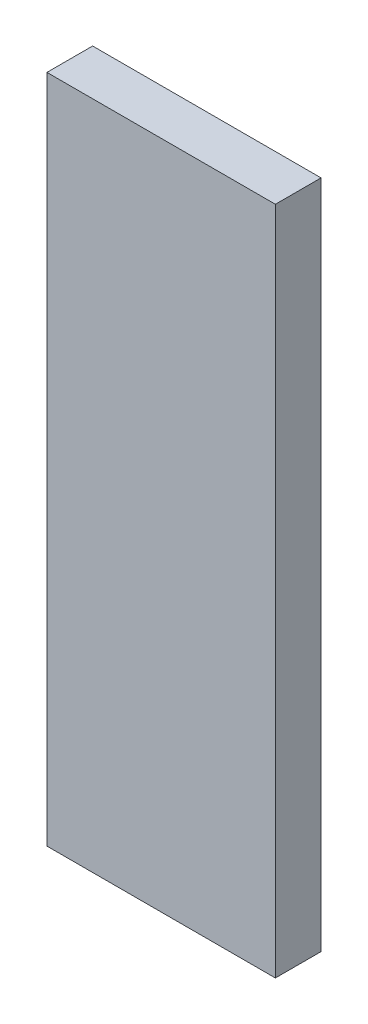
ISO-10303-21;
HEADER;
FILE_DESCRIPTION(('STEP AP214'),'2;1');
FILE_NAME('part.step','',(''),(''),'','','');
FILE_SCHEMA(('AUTOMOTIVE_DESIGN { 1 0 10303 214 1 1 1 1 }'));
ENDSEC;
DATA;
#1=APPLICATION_CONTEXT('core data for automotive mechanical design processes');
#2=APPLICATION_PROTOCOL_DEFINITION('international standard','automotive_design',2000,#1);
#3=PRODUCT_CONTEXT('',#1,'mechanical');
#4=PRODUCT('Part','Part','',(#3));
#5=PRODUCT_RELATED_PRODUCT_CATEGORY('part','',(#4));
#6=PRODUCT_DEFINITION_FORMATION('','',#4);
#7=PRODUCT_DEFINITION_CONTEXT('part definition',#1,'design');
#8=PRODUCT_DEFINITION('design','',#6,#7);
#9=PRODUCT_DEFINITION_SHAPE('','',#8);
#10=(LENGTH_UNIT() NAMED_UNIT(*) SI_UNIT(.MILLI.,.METRE.));
#11=(NAMED_UNIT(*) PLANE_ANGLE_UNIT() SI_UNIT($,.RADIAN.));
#12=(NAMED_UNIT(*) SI_UNIT($,.STERADIAN.) SOLID_ANGLE_UNIT());
#13=UNCERTAINTY_MEASURE_WITH_UNIT(LENGTH_MEASURE(1.E-05),#10,'distance_accuracy_value','');
#14=(GEOMETRIC_REPRESENTATION_CONTEXT(3) GLOBAL_UNCERTAINTY_ASSIGNED_CONTEXT((#13)) GLOBAL_UNIT_ASSIGNED_CONTEXT((#10,
#11,#12)) REPRESENTATION_CONTEXT('',''));
#15=CARTESIAN_POINT('',(0.,0.,0.));
#16=DIRECTION('',(0.,0.,1.));
#17=DIRECTION('',(1.,0.,0.));
#18=AXIS2_PLACEMENT_3D('',#15,#16,#17);
#19=CARTESIAN_POINT('',(7.5,-22.,3.));
#20=DIRECTION('',(-1.,0.,0.));
#21=DIRECTION('',(0.,0.,1.));
#22=AXIS2_PLACEMENT_3D('',#19,#20,#21);
#23=PLANE('',#22);
#24=DIRECTION('',(0.,1.,0.));
#25=VECTOR('',#24,1.);
#26=CARTESIAN_POINT('',(7.5,-22.,0.));
#27=LINE('',#26,#25);
#28=CARTESIAN_POINT('',(7.5,-22.,0.));
#29=VERTEX_POINT('',#28);
#30=CARTESIAN_POINT('',(7.5,22.,0.));
#31=VERTEX_POINT('',#30);
#32=EDGE_CURVE('E103',#29,#31,#27,.T.);
#33=ORIENTED_EDGE('',*,*,#32,.T.);
#34=DIRECTION('',(0.,0.,-1.));
#35=VECTOR('',#34,1.);
#36=CARTESIAN_POINT('',(7.5,22.,3.));
#37=LINE('',#36,#35);
#38=CARTESIAN_POINT('',(7.5,22.,3.));
#39=VERTEX_POINT('',#38);
#40=EDGE_CURVE('E11',#39,#31,#37,.T.);
#41=ORIENTED_EDGE('',*,*,#40,.F.);
#42=DIRECTION('',(0.,1.,0.));
#43=VECTOR('',#42,1.);
#44=CARTESIAN_POINT('',(7.5,-22.,3.));
#45=LINE('',#44,#43);
#46=CARTESIAN_POINT('',(7.5,-22.,3.));
#47=VERTEX_POINT('',#46);
#48=EDGE_CURVE('E91',#47,#39,#45,.T.);
#49=ORIENTED_EDGE('',*,*,#48,.F.);
#50=DIRECTION('',(0.,0.,-1.));
#51=VECTOR('',#50,1.);
#52=CARTESIAN_POINT('',(7.5,-22.,3.));
#53=LINE('',#52,#51);
#54=EDGE_CURVE('E99',#47,#29,#53,.T.);
#55=ORIENTED_EDGE('',*,*,#54,.T.);
#56=EDGE_LOOP('',(#33,#41,#49,#55));
#57=FACE_BOUND('',#56,.T.);
#58=ADVANCED_FACE('F40',(#57),#23,.F.);
#59=CARTESIAN_POINT('',(-7.5,22.,3.));
#60=DIRECTION('',(0.,-1.,0.));
#61=DIRECTION('',(0.,0.,-1.));
#62=AXIS2_PLACEMENT_3D('',#59,#60,#61);
#63=PLANE('',#62);
#64=DIRECTION('',(-1.,0.,0.));
#65=VECTOR('',#64,1.);
#66=CARTESIAN_POINT('',(-7.5,22.,0.));
#67=LINE('',#66,#65);
#68=CARTESIAN_POINT('',(-7.5,22.,0.));
#69=VERTEX_POINT('',#68);
#70=EDGE_CURVE('E95',#31,#69,#67,.T.);
#71=ORIENTED_EDGE('',*,*,#70,.T.);
#72=DIRECTION('',(0.,0.,-1.));
#73=VECTOR('',#72,1.);
#74=CARTESIAN_POINT('',(-7.5,22.,3.));
#75=LINE('',#74,#73);
#76=CARTESIAN_POINT('',(-7.5,22.,3.));
#77=VERTEX_POINT('',#76);
#78=EDGE_CURVE('E48',#77,#69,#75,.T.);
#79=ORIENTED_EDGE('',*,*,#78,.F.);
#80=DIRECTION('',(-1.,0.,0.));
#81=VECTOR('',#80,1.);
#82=CARTESIAN_POINT('',(-7.5,22.,3.));
#83=LINE('',#82,#81);
#84=EDGE_CURVE('E86',#39,#77,#83,.T.);
#85=ORIENTED_EDGE('',*,*,#84,.F.);
#86=ORIENTED_EDGE('',*,*,#40,.T.);
#87=EDGE_LOOP('',(#71,#79,#85,#86));
#88=FACE_BOUND('',#87,.T.);
#89=ADVANCED_FACE('F94',(#88),#63,.F.);
#90=CARTESIAN_POINT('',(-7.5,-22.,3.));
#91=DIRECTION('',(1.,0.,0.));
#92=DIRECTION('',(0.,0.,-1.));
#93=AXIS2_PLACEMENT_3D('',#90,#91,#92);
#94=PLANE('',#93);
#95=DIRECTION('',(0.,-1.,0.));
#96=VECTOR('',#95,1.);
#97=CARTESIAN_POINT('',(-7.5,-22.,0.));
#98=LINE('',#97,#96);
#99=CARTESIAN_POINT('',(-7.5,-22.,0.));
#100=VERTEX_POINT('',#99);
#101=EDGE_CURVE('E73',#69,#100,#98,.T.);
#102=ORIENTED_EDGE('',*,*,#101,.T.);
#103=DIRECTION('',(0.,0.,-1.));
#104=VECTOR('',#103,1.);
#105=CARTESIAN_POINT('',(-7.5,-22.,3.));
#106=LINE('',#105,#104);
#107=CARTESIAN_POINT('',(-7.5,-22.,3.));
#108=VERTEX_POINT('',#107);
#109=EDGE_CURVE('E96',#108,#100,#106,.T.);
#110=ORIENTED_EDGE('',*,*,#109,.F.);
#111=DIRECTION('',(0.,-1.,0.));
#112=VECTOR('',#111,1.);
#113=CARTESIAN_POINT('',(-7.5,-22.,3.));
#114=LINE('',#113,#112);
#115=EDGE_CURVE('E89',#77,#108,#114,.T.);
#116=ORIENTED_EDGE('',*,*,#115,.F.);
#117=ORIENTED_EDGE('',*,*,#78,.T.);
#118=EDGE_LOOP('',(#102,#110,#116,#117));
#119=FACE_BOUND('',#118,.T.);
#120=ADVANCED_FACE('F97',(#119),#94,.F.);
#121=CARTESIAN_POINT('',(-7.5,-22.,3.));
#122=DIRECTION('',(0.,1.,0.));
#123=DIRECTION('',(0.,0.,1.));
#124=AXIS2_PLACEMENT_3D('',#121,#122,#123);
#125=PLANE('',#124);
#126=DIRECTION('',(1.,0.,0.));
#127=VECTOR('',#126,1.);
#128=CARTESIAN_POINT('',(-7.5,-22.,0.));
#129=LINE('',#128,#127);
#130=EDGE_CURVE('E79',#100,#29,#129,.T.);
#131=ORIENTED_EDGE('',*,*,#130,.T.);
#132=ORIENTED_EDGE('',*,*,#54,.F.);
#133=DIRECTION('',(1.,0.,0.));
#134=VECTOR('',#133,1.);
#135=CARTESIAN_POINT('',(-7.5,-22.,3.));
#136=LINE('',#135,#134);
#137=EDGE_CURVE('E56',#108,#47,#136,.T.);
#138=ORIENTED_EDGE('',*,*,#137,.F.);
#139=ORIENTED_EDGE('',*,*,#109,.T.);
#140=EDGE_LOOP('',(#131,#132,#138,#139));
#141=FACE_BOUND('',#140,.T.);
#142=ADVANCED_FACE('F110',(#141),#125,.F.);
#143=CARTESIAN_POINT('',(0.,0.,3.));
#144=DIRECTION('',(0.,0.,-1.));
#145=DIRECTION('',(-1.,0.,0.));
#146=AXIS2_PLACEMENT_3D('',#143,#144,#145);
#147=PLANE('',#146);
#148=ORIENTED_EDGE('',*,*,#48,.T.);
#149=ORIENTED_EDGE('',*,*,#84,.T.);
#150=ORIENTED_EDGE('',*,*,#115,.T.);
#151=ORIENTED_EDGE('',*,*,#137,.T.);
#152=EDGE_LOOP('',(#148,#149,#150,#151));
#153=FACE_BOUND('',#152,.T.);
#154=ADVANCED_FACE('F87',(#153),#147,.F.);
#155=CARTESIAN_POINT('',(0.,0.,0.));
#156=DIRECTION('',(0.,0.,-1.));
#157=DIRECTION('',(-1.,0.,0.));
#158=AXIS2_PLACEMENT_3D('',#155,#156,#157);
#159=PLANE('',#158);
#160=ORIENTED_EDGE('',*,*,#32,.F.);
#161=ORIENTED_EDGE('',*,*,#130,.F.);
#162=ORIENTED_EDGE('',*,*,#101,.F.);
#163=ORIENTED_EDGE('',*,*,#70,.F.);
#164=EDGE_LOOP('',(#160,#161,#162,#163));
#165=FACE_BOUND('',#164,.T.);
#166=ADVANCED_FACE('F113',(#165),#159,.T.);
#167=CLOSED_SHELL('',(#58,#89,#120,#142,#154,#166));
#168=MANIFOLD_SOLID_BREP('B2',#167);
#169=ADVANCED_BREP_SHAPE_REPRESENTATION('',(#18,#168),#14);
#170=SHAPE_DEFINITION_REPRESENTATION(#9,#169);
ENDSEC;
END-ISO-10303-21;
